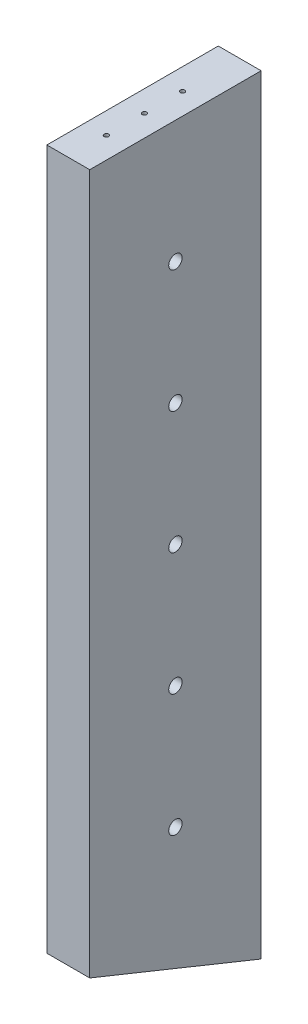
ISO-10303-21;
HEADER;
FILE_DESCRIPTION(('STEP AP214'),'2;1');
FILE_NAME('part.step','',(''),(''),'','','');
FILE_SCHEMA(('AUTOMOTIVE_DESIGN { 1 0 10303 214 1 1 1 1 }'));
ENDSEC;
DATA;
#1=APPLICATION_CONTEXT('core data for automotive mechanical design processes');
#2=APPLICATION_PROTOCOL_DEFINITION('international standard','automotive_design',2000,#1);
#3=PRODUCT_CONTEXT('',#1,'mechanical');
#4=PRODUCT('Part','Part','',(#3));
#5=PRODUCT_RELATED_PRODUCT_CATEGORY('part','',(#4));
#6=PRODUCT_DEFINITION_FORMATION('','',#4);
#7=PRODUCT_DEFINITION_CONTEXT('part definition',#1,'design');
#8=PRODUCT_DEFINITION('design','',#6,#7);
#9=PRODUCT_DEFINITION_SHAPE('','',#8);
#10=(LENGTH_UNIT() NAMED_UNIT(*) SI_UNIT(.MILLI.,.METRE.));
#11=(NAMED_UNIT(*) PLANE_ANGLE_UNIT() SI_UNIT($,.RADIAN.));
#12=(NAMED_UNIT(*) SI_UNIT($,.STERADIAN.) SOLID_ANGLE_UNIT());
#13=UNCERTAINTY_MEASURE_WITH_UNIT(LENGTH_MEASURE(1.E-05),#10,'distance_accuracy_value','');
#14=(GEOMETRIC_REPRESENTATION_CONTEXT(3) GLOBAL_UNCERTAINTY_ASSIGNED_CONTEXT((#13)) GLOBAL_UNIT_ASSIGNED_CONTEXT((#10,
#11,#12)) REPRESENTATION_CONTEXT('',''));
#15=CARTESIAN_POINT('',(0.,0.,0.));
#16=DIRECTION('',(0.,0.,1.));
#17=DIRECTION('',(1.,0.,0.));
#18=AXIS2_PLACEMENT_3D('',#15,#16,#17);
#19=CARTESIAN_POINT('',(475.477307398307,6641.74188680895,76.2));
#20=DIRECTION('',(1.,0.,0.));
#21=DIRECTION('',(0.,0.,-1.));
#22=AXIS2_PLACEMENT_3D('',#19,#20,#21);
#23=PLANE('',#22);
#24=CARTESIAN_POINT('',(475.477307398307,6929.29753945549,38.1));
#25=DIRECTION('',(-1.,0.,0.));
#26=DIRECTION('',(0.,0.,1.));
#27=AXIS2_PLACEMENT_3D('',#24,#25,#26);
#28=CIRCLE('',#27,2.9766259999997);
#29=CARTESIAN_POINT('',(475.477307398307,6929.29753945549,41.0766259999997));
#30=VERTEX_POINT('',#29);
#31=EDGE_CURVE('E469',#30,#30,#28,.T.);
#32=ORIENTED_EDGE('',*,*,#31,.F.);
#33=EDGE_LOOP('',(#32));
#34=FACE_BOUND('',#33,.T.);
#35=CARTESIAN_POINT('',(475.477307398307,6711.56773671735,38.1));
#36=DIRECTION('',(-1.,0.,0.));
#37=DIRECTION('',(0.,0.,1.));
#38=AXIS2_PLACEMENT_3D('',#35,#36,#37);
#39=CIRCLE('',#38,2.9766259999997);
#40=CARTESIAN_POINT('',(475.477307398307,6711.56773671735,41.0766259999997));
#41=VERTEX_POINT('',#40);
#42=EDGE_CURVE('E491',#41,#41,#39,.T.);
#43=ORIENTED_EDGE('',*,*,#42,.F.);
#44=EDGE_LOOP('',(#43));
#45=FACE_BOUND('',#44,.T.);
#46=DIRECTION('',(0.,-1.,0.));
#47=VECTOR('',#46,1.);
#48=CARTESIAN_POINT('',(475.477307398307,6641.74188680895,0.));
#49=LINE('',#48,#47);
#50=CARTESIAN_POINT('',(475.477307398307,6983.72999014002,0.));
#51=VERTEX_POINT('',#50);
#52=CARTESIAN_POINT('',(475.477307398307,6641.74188680895,0.));
#53=VERTEX_POINT('',#52);
#54=EDGE_CURVE('E84',#51,#53,#49,.T.);
#55=ORIENTED_EDGE('',*,*,#54,.T.);
#56=DIRECTION('',(0.,-0.374606593824928,-0.927183854401534));
#57=VECTOR('',#56,1.);
#58=CARTESIAN_POINT('',(475.477307398307,6641.74188680895,0.));
#59=LINE('',#58,#57);
#60=CARTESIAN_POINT('',(475.477307398307,6672.52868525669,76.2));
#61=VERTEX_POINT('',#60);
#62=EDGE_CURVE('E69',#61,#53,#59,.T.);
#63=ORIENTED_EDGE('',*,*,#62,.F.);
#64=DIRECTION('',(0.,-1.,0.));
#65=VECTOR('',#64,1.);
#66=CARTESIAN_POINT('',(475.477307398307,6641.74188680895,76.2));
#67=LINE('',#66,#65);
#68=CARTESIAN_POINT('',(475.477307398307,6983.72999014002,76.2));
#69=VERTEX_POINT('',#68);
#70=EDGE_CURVE('E96',#69,#61,#67,.T.);
#71=ORIENTED_EDGE('',*,*,#70,.F.);
#72=DIRECTION('',(0.,0.,-1.));
#73=VECTOR('',#72,1.);
#74=CARTESIAN_POINT('',(475.477307398307,6983.72999014002,76.2));
#75=LINE('',#74,#73);
#76=EDGE_CURVE('E42',#69,#51,#75,.T.);
#77=ORIENTED_EDGE('',*,*,#76,.T.);
#78=EDGE_LOOP('',(#55,#63,#71,#77));
#79=FACE_BOUND('',#78,.T.);
#80=CARTESIAN_POINT('',(475.477307398307,6766.00018740189,38.1));
#81=DIRECTION('',(-1.,0.,0.));
#82=DIRECTION('',(0.,0.,1.));
#83=AXIS2_PLACEMENT_3D('',#80,#81,#82);
#84=CIRCLE('',#83,2.9766259999997);
#85=CARTESIAN_POINT('',(475.477307398307,6766.00018740189,41.0766259999997));
#86=VERTEX_POINT('',#85);
#87=EDGE_CURVE('E485',#86,#86,#84,.T.);
#88=ORIENTED_EDGE('',*,*,#87,.F.);
#89=EDGE_LOOP('',(#88));
#90=FACE_BOUND('',#89,.T.);
#91=CARTESIAN_POINT('',(475.477307398307,6820.43263808642,38.1));
#92=DIRECTION('',(-1.,0.,0.));
#93=DIRECTION('',(0.,0.,1.));
#94=AXIS2_PLACEMENT_3D('',#91,#92,#93);
#95=CIRCLE('',#94,2.9766259999997);
#96=CARTESIAN_POINT('',(475.477307398307,6820.43263808642,41.0766259999997));
#97=VERTEX_POINT('',#96);
#98=EDGE_CURVE('E479',#97,#97,#95,.T.);
#99=ORIENTED_EDGE('',*,*,#98,.F.);
#100=EDGE_LOOP('',(#99));
#101=FACE_BOUND('',#100,.T.);
#102=CARTESIAN_POINT('',(475.477307398307,6874.86508877095,38.1));
#103=DIRECTION('',(-1.,0.,0.));
#104=DIRECTION('',(0.,0.,1.));
#105=AXIS2_PLACEMENT_3D('',#102,#103,#104);
#106=CIRCLE('',#105,2.9766259999997);
#107=CARTESIAN_POINT('',(475.477307398307,6874.86508877095,41.0766259999997));
#108=VERTEX_POINT('',#107);
#109=EDGE_CURVE('E471',#108,#108,#106,.T.);
#110=ORIENTED_EDGE('',*,*,#109,.F.);
#111=EDGE_LOOP('',(#110));
#112=FACE_BOUND('',#111,.T.);
#113=ADVANCED_FACE('F32',(#34,#45,#79,#90,#101,#112),#23,.F.);
#114=CARTESIAN_POINT('',(494.527307398307,6641.74188680895,76.2));
#115=DIRECTION('',(-1.,0.,0.));
#116=DIRECTION('',(0.,0.,1.));
#117=AXIS2_PLACEMENT_3D('',#114,#115,#116);
#118=PLANE('',#117);
#119=CARTESIAN_POINT('',(494.527307398307,6929.29753945549,38.1));
#120=DIRECTION('',(-1.,0.,0.));
#121=DIRECTION('',(0.,0.,1.));
#122=AXIS2_PLACEMENT_3D('',#119,#120,#121);
#123=CIRCLE('',#122,2.9766259999997);
#124=CARTESIAN_POINT('',(494.527307398307,6929.29753945549,41.0766259999997));
#125=VERTEX_POINT('',#124);
#126=EDGE_CURVE('E467',#125,#125,#123,.T.);
#127=ORIENTED_EDGE('',*,*,#126,.T.);
#128=EDGE_LOOP('',(#127));
#129=FACE_BOUND('',#128,.T.);
#130=CARTESIAN_POINT('',(494.527307398307,6874.86508877095,38.1));
#131=DIRECTION('',(-1.,0.,0.));
#132=DIRECTION('',(0.,0.,1.));
#133=AXIS2_PLACEMENT_3D('',#130,#131,#132);
#134=CIRCLE('',#133,2.9766259999997);
#135=CARTESIAN_POINT('',(494.527307398307,6874.86508877095,41.0766259999997));
#136=VERTEX_POINT('',#135);
#137=EDGE_CURVE('E476',#136,#136,#134,.T.);
#138=ORIENTED_EDGE('',*,*,#137,.T.);
#139=EDGE_LOOP('',(#138));
#140=FACE_BOUND('',#139,.T.);
#141=CARTESIAN_POINT('',(494.527307398307,6820.43263808642,38.1));
#142=DIRECTION('',(-1.,0.,0.));
#143=DIRECTION('',(0.,0.,1.));
#144=AXIS2_PLACEMENT_3D('',#141,#142,#143);
#145=CIRCLE('',#144,2.9766259999997);
#146=CARTESIAN_POINT('',(494.527307398307,6820.43263808642,41.0766259999997));
#147=VERTEX_POINT('',#146);
#148=EDGE_CURVE('E482',#147,#147,#145,.T.);
#149=ORIENTED_EDGE('',*,*,#148,.T.);
#150=EDGE_LOOP('',(#149));
#151=FACE_BOUND('',#150,.T.);
#152=CARTESIAN_POINT('',(494.527307398307,6766.00018740189,38.1));
#153=DIRECTION('',(-1.,0.,0.));
#154=DIRECTION('',(0.,0.,1.));
#155=AXIS2_PLACEMENT_3D('',#152,#153,#154);
#156=CIRCLE('',#155,2.9766259999997);
#157=CARTESIAN_POINT('',(494.527307398307,6766.00018740189,41.0766259999997));
#158=VERTEX_POINT('',#157);
#159=EDGE_CURVE('E488',#158,#158,#156,.T.);
#160=ORIENTED_EDGE('',*,*,#159,.T.);
#161=EDGE_LOOP('',(#160));
#162=FACE_BOUND('',#161,.T.);
#163=CARTESIAN_POINT('',(494.527307398307,6711.56773671735,38.1));
#164=DIRECTION('',(-1.,0.,0.));
#165=DIRECTION('',(0.,0.,1.));
#166=AXIS2_PLACEMENT_3D('',#163,#164,#165);
#167=CIRCLE('',#166,2.9766259999997);
#168=CARTESIAN_POINT('',(494.527307398307,6711.56773671735,41.0766259999997));
#169=VERTEX_POINT('',#168);
#170=EDGE_CURVE('E174',#169,#169,#167,.T.);
#171=ORIENTED_EDGE('',*,*,#170,.T.);
#172=EDGE_LOOP('',(#171));
#173=FACE_BOUND('',#172,.T.);
#174=DIRECTION('',(0.,1.,0.));
#175=VECTOR('',#174,1.);
#176=CARTESIAN_POINT('',(494.527307398307,6641.74188680895,76.2));
#177=LINE('',#176,#175);
#178=CARTESIAN_POINT('',(494.527307398307,6672.52868525669,76.2));
#179=VERTEX_POINT('',#178);
#180=CARTESIAN_POINT('',(494.527307398307,6983.72999014003,76.2));
#181=VERTEX_POINT('',#180);
#182=EDGE_CURVE('E91',#179,#181,#177,.T.);
#183=ORIENTED_EDGE('',*,*,#182,.F.);
#184=DIRECTION('',(0.,0.374606593824928,0.927183854401534));
#185=VECTOR('',#184,1.);
#186=CARTESIAN_POINT('',(494.527307398307,6641.74188680895,0.));
#187=LINE('',#186,#185);
#188=CARTESIAN_POINT('',(494.527307398307,6641.74188680895,0.));
#189=VERTEX_POINT('',#188);
#190=EDGE_CURVE('E100',#189,#179,#187,.T.);
#191=ORIENTED_EDGE('',*,*,#190,.F.);
#192=DIRECTION('',(0.,1.,0.));
#193=VECTOR('',#192,1.);
#194=CARTESIAN_POINT('',(494.527307398307,6641.74188680895,0.));
#195=LINE('',#194,#193);
#196=CARTESIAN_POINT('',(494.527307398307,6983.72999014003,0.));
#197=VERTEX_POINT('',#196);
#198=EDGE_CURVE('E81',#189,#197,#195,.T.);
#199=ORIENTED_EDGE('',*,*,#198,.T.);
#200=DIRECTION('',(0.,0.,-1.));
#201=VECTOR('',#200,1.);
#202=CARTESIAN_POINT('',(494.527307398307,6983.72999014003,76.2));
#203=LINE('',#202,#201);
#204=EDGE_CURVE('E11',#181,#197,#203,.T.);
#205=ORIENTED_EDGE('',*,*,#204,.F.);
#206=EDGE_LOOP('',(#183,#191,#199,#205));
#207=FACE_BOUND('',#206,.T.);
#208=ADVANCED_FACE('F34',(#129,#140,#151,#162,#173,#207),#118,.F.);
#209=CARTESIAN_POINT('',(494.527307398307,6983.72999014003,76.2));
#210=DIRECTION('',(5.59482469102441E-13,-1.,0.));
#211=DIRECTION('',(1.,5.59482469102441E-13,0.));
#212=AXIS2_PLACEMENT_3D('',#209,#210,#211);
#213=PLANE('',#212);
#214=CARTESIAN_POINT('',(485.002307398307,6983.72999014003,25.4));
#215=DIRECTION('',(0.,1.,0.));
#216=DIRECTION('',(0.,0.,1.));
#217=AXIS2_PLACEMENT_3D('',#214,#215,#216);
#218=CIRCLE('',#217,0.992251);
#219=CARTESIAN_POINT('',(485.002307398307,6983.72999014003,26.392251));
#220=VERTEX_POINT('',#219);
#221=EDGE_CURVE('E186',#220,#220,#218,.T.);
#222=ORIENTED_EDGE('',*,*,#221,.F.);
#223=EDGE_LOOP('',(#222));
#224=FACE_BOUND('',#223,.T.);
#225=CARTESIAN_POINT('',(485.002307398307,6983.72999014003,42.3333333333333));
#226=DIRECTION('',(0.,1.,0.));
#227=DIRECTION('',(0.,0.,1.));
#228=AXIS2_PLACEMENT_3D('',#225,#226,#227);
#229=CIRCLE('',#228,0.992251);
#230=CARTESIAN_POINT('',(485.002307398307,6983.72999014003,43.3255843333333));
#231=VERTEX_POINT('',#230);
#232=EDGE_CURVE('E192',#231,#231,#229,.T.);
#233=ORIENTED_EDGE('',*,*,#232,.F.);
#234=EDGE_LOOP('',(#233));
#235=FACE_BOUND('',#234,.T.);
#236=CARTESIAN_POINT('',(485.002307398307,6983.72999014003,59.2666666666667));
#237=DIRECTION('',(0.,1.,0.));
#238=DIRECTION('',(0.,0.,1.));
#239=AXIS2_PLACEMENT_3D('',#236,#237,#238);
#240=CIRCLE('',#239,0.992251);
#241=CARTESIAN_POINT('',(485.002307398307,6983.72999014003,60.2589176666667));
#242=VERTEX_POINT('',#241);
#243=EDGE_CURVE('E198',#242,#242,#240,.T.);
#244=ORIENTED_EDGE('',*,*,#243,.F.);
#245=EDGE_LOOP('',(#244));
#246=FACE_BOUND('',#245,.T.);
#247=DIRECTION('',(-1.,-5.59482469102441E-13,0.));
#248=VECTOR('',#247,1.);
#249=CARTESIAN_POINT('',(494.527307398307,6983.72999014003,0.));
#250=LINE('',#249,#248);
#251=EDGE_CURVE('E62',#197,#51,#250,.T.);
#252=ORIENTED_EDGE('',*,*,#251,.T.);
#253=ORIENTED_EDGE('',*,*,#76,.F.);
#254=DIRECTION('',(-1.,-5.59482469102441E-13,0.));
#255=VECTOR('',#254,1.);
#256=CARTESIAN_POINT('',(494.527307398307,6983.72999014003,76.2));
#257=LINE('',#256,#255);
#258=EDGE_CURVE('E51',#181,#69,#257,.T.);
#259=ORIENTED_EDGE('',*,*,#258,.F.);
#260=ORIENTED_EDGE('',*,*,#204,.T.);
#261=EDGE_LOOP('',(#252,#253,#259,#260));
#262=FACE_BOUND('',#261,.T.);
#263=ADVANCED_FACE('F243',(#224,#235,#246,#262),#213,.F.);
#264=CARTESIAN_POINT('',(0.,0.,76.2));
#265=DIRECTION('',(0.,0.,1.));
#266=DIRECTION('',(1.,0.,0.));
#267=AXIS2_PLACEMENT_3D('',#264,#265,#266);
#268=PLANE('',#267);
#269=DIRECTION('',(1.,0.,0.));
#270=VECTOR('',#269,1.);
#271=CARTESIAN_POINT('',(475.476307398307,6672.52868525669,76.2));
#272=LINE('',#271,#270);
#273=EDGE_CURVE('E78',#61,#179,#272,.T.);
#274=ORIENTED_EDGE('',*,*,#273,.T.);
#275=ORIENTED_EDGE('',*,*,#182,.T.);
#276=ORIENTED_EDGE('',*,*,#258,.T.);
#277=ORIENTED_EDGE('',*,*,#70,.T.);
#278=EDGE_LOOP('',(#274,#275,#276,#277));
#279=FACE_BOUND('',#278,.T.);
#280=ADVANCED_FACE('F129',(#279),#268,.T.);
#281=CARTESIAN_POINT('',(0.,0.,0.));
#282=DIRECTION('',(0.,0.,1.));
#283=DIRECTION('',(1.,0.,0.));
#284=AXIS2_PLACEMENT_3D('',#281,#282,#283);
#285=PLANE('',#284);
#286=CARTESIAN_POINT('',(485.002307398328,6660.33593847449,0.));
#287=DIRECTION('',(0.,0.,1.));
#288=DIRECTION('',(1.,0.,0.));
#289=AXIS2_PLACEMENT_3D('',#286,#287,#288);
#290=CIRCLE('',#289,0.992251);
#291=CARTESIAN_POINT('',(485.994558398328,6660.33593847449,0.));
#292=VERTEX_POINT('',#291);
#293=EDGE_CURVE('E36',#292,#292,#290,.T.);
#294=ORIENTED_EDGE('',*,*,#293,.T.);
#295=EDGE_LOOP('',(#294));
#296=FACE_BOUND('',#295,.T.);
#297=CARTESIAN_POINT('',(485.002307398328,6812.73593847449,0.));
#298=DIRECTION('',(0.,0.,1.));
#299=DIRECTION('',(1.,0.,0.));
#300=AXIS2_PLACEMENT_3D('',#297,#298,#299);
#301=CIRCLE('',#300,0.992251);
#302=CARTESIAN_POINT('',(485.994558398328,6812.73593847449,0.));
#303=VERTEX_POINT('',#302);
#304=EDGE_CURVE('E102',#303,#303,#301,.T.);
#305=ORIENTED_EDGE('',*,*,#304,.T.);
#306=EDGE_LOOP('',(#305));
#307=FACE_BOUND('',#306,.T.);
#308=CARTESIAN_POINT('',(485.002307398328,6965.13593847449,0.));
#309=DIRECTION('',(0.,0.,1.));
#310=DIRECTION('',(1.,0.,0.));
#311=AXIS2_PLACEMENT_3D('',#308,#309,#310);
#312=CIRCLE('',#311,0.992251);
#313=CARTESIAN_POINT('',(485.994558398328,6965.13593847449,0.));
#314=VERTEX_POINT('',#313);
#315=EDGE_CURVE('E98',#314,#314,#312,.T.);
#316=ORIENTED_EDGE('',*,*,#315,.T.);
#317=EDGE_LOOP('',(#316));
#318=FACE_BOUND('',#317,.T.);
#319=ORIENTED_EDGE('',*,*,#198,.F.);
#320=DIRECTION('',(1.,0.,0.));
#321=VECTOR('',#320,1.);
#322=CARTESIAN_POINT('',(494.527307398307,6641.74188680895,0.));
#323=LINE('',#322,#321);
#324=EDGE_CURVE('E75',#53,#189,#323,.T.);
#325=ORIENTED_EDGE('',*,*,#324,.F.);
#326=ORIENTED_EDGE('',*,*,#54,.F.);
#327=ORIENTED_EDGE('',*,*,#251,.F.);
#328=EDGE_LOOP('',(#319,#325,#326,#327));
#329=FACE_BOUND('',#328,.T.);
#330=ADVANCED_FACE('F89',(#296,#307,#318,#329),#285,.F.);
#331=CARTESIAN_POINT('',(475.476307398307,6641.74188680895,0.));
#332=DIRECTION('',(0.,0.927183854401535,-0.374606593824928));
#333=DIRECTION('',(0.,0.374606593824928,0.927183854401535));
#334=AXIS2_PLACEMENT_3D('',#331,#332,#333);
#335=PLANE('',#334);
#336=CARTESIAN_POINT('',(485.002307398307,6666.23100555876,60.6126957924156));
#337=DIRECTION('',(0.,-0.927183854401535,0.374606593824928));
#338=DIRECTION('',(0.,-0.374606593824928,-0.927183854401535));
#339=AXIS2_PLACEMENT_3D('',#336,#337,#338);
#340=CIRCLE('',#339,0.992251);
#341=CARTESIAN_POINT('',(485.002307398307,6665.85930179143,59.6926966857018));
#342=VERTEX_POINT('',#341);
#343=EDGE_CURVE('E168',#342,#342,#340,.T.);
#344=ORIENTED_EDGE('',*,*,#343,.F.);
#345=EDGE_LOOP('',(#344));
#346=FACE_BOUND('',#345,.T.);
#347=CARTESIAN_POINT('',(485.002307398307,6659.93332586082,45.025391584832));
#348=DIRECTION('',(0.,-0.927183854401535,0.374606593824928));
#349=DIRECTION('',(0.,-0.374606593824928,-0.927183854401535));
#350=AXIS2_PLACEMENT_3D('',#347,#348,#349);
#351=CIRCLE('',#350,0.992251);
#352=CARTESIAN_POINT('',(485.002307398307,6659.56162209349,44.1053924781182));
#353=VERTEX_POINT('',#352);
#354=EDGE_CURVE('E167',#353,#353,#351,.T.);
#355=ORIENTED_EDGE('',*,*,#354,.F.);
#356=EDGE_LOOP('',(#355));
#357=FACE_BOUND('',#356,.T.);
#358=CARTESIAN_POINT('',(485.002307398307,6653.63564616289,29.4380873772484));
#359=DIRECTION('',(0.,-0.927183854401535,0.374606593824928));
#360=DIRECTION('',(0.,-0.374606593824928,-0.927183854401535));
#361=AXIS2_PLACEMENT_3D('',#358,#359,#360);
#362=CIRCLE('',#361,0.992251);
#363=CARTESIAN_POINT('',(485.002307398307,6653.26394239556,28.5180882705346));
#364=VERTEX_POINT('',#363);
#365=EDGE_CURVE('E180',#364,#364,#362,.T.);
#366=ORIENTED_EDGE('',*,*,#365,.F.);
#367=EDGE_LOOP('',(#366));
#368=FACE_BOUND('',#367,.T.);
#369=ORIENTED_EDGE('',*,*,#62,.T.);
#370=ORIENTED_EDGE('',*,*,#324,.T.);
#371=ORIENTED_EDGE('',*,*,#190,.T.);
#372=ORIENTED_EDGE('',*,*,#273,.F.);
#373=EDGE_LOOP('',(#369,#370,#371,#372));
#374=FACE_BOUND('',#373,.T.);
#375=ADVANCED_FACE('F71',(#346,#357,#368,#374),#335,.F.);
#376=CARTESIAN_POINT('',(485.002307398328,6965.13593846609,-19.050000046008));
#377=DIRECTION('',(0.,-4.41081850666353E-10,-1.));
#378=DIRECTION('',(0.,1.,-4.41081850666353E-10));
#379=AXIS2_PLACEMENT_3D('',#376,#377,#378);
#380=CYLINDRICAL_SURFACE('',#379,0.992251);
#381=CARTESIAN_POINT('',(485.002307398328,6965.13593848289,19.049999953992));
#382=DIRECTION('',(0.,-4.41081850666353E-10,-1.));
#383=DIRECTION('',(0.,1.,-4.41081850666353E-10));
#384=AXIS2_PLACEMENT_3D('',#381,#382,#383);
#385=CIRCLE('',#384,0.992251);
#386=CARTESIAN_POINT('',(485.002307398328,6966.12818948289,19.0499999535544));
#387=VERTEX_POINT('',#386);
#388=EDGE_CURVE('E101',#387,#387,#385,.T.);
#389=ORIENTED_EDGE('',*,*,#388,.F.);
#390=EDGE_LOOP('',(#389));
#391=FACE_BOUND('',#390,.T.);
#392=ORIENTED_EDGE('',*,*,#315,.F.);
#393=EDGE_LOOP('',(#392));
#394=FACE_BOUND('',#393,.T.);
#395=ADVANCED_FACE('F221',(#391,#394),#380,.F.);
#396=CARTESIAN_POINT('',(485.002307398328,6965.13593848289,19.049999953992));
#397=DIRECTION('',(0.,-4.41081850666353E-10,-1.));
#398=DIRECTION('',(0.,1.,-4.41081850666353E-10));
#399=AXIS2_PLACEMENT_3D('',#396,#397,#398);
#400=CONICAL_SURFACE('',#399,0.992251,1.02974425867666);
#401=CARTESIAN_POINT('',(485.002307398328,6965.13593848315,19.6462045040827));
#402=VERTEX_POINT('',#401);
#403=VERTEX_LOOP('',#402);
#404=FACE_BOUND('',#403,.T.);
#405=ORIENTED_EDGE('',*,*,#388,.T.);
#406=EDGE_LOOP('',(#405));
#407=FACE_BOUND('',#406,.T.);
#408=ADVANCED_FACE('F223',(#404,#407),#400,.F.);
#409=CARTESIAN_POINT('',(485.002307398328,6812.73593846609,-19.0499999787871));
#410=DIRECTION('',(0.,-4.41081850666353E-10,-1.));
#411=DIRECTION('',(0.,1.,-4.41081850666353E-10));
#412=AXIS2_PLACEMENT_3D('',#409,#410,#411);
#413=CYLINDRICAL_SURFACE('',#412,0.992251);
#414=CARTESIAN_POINT('',(485.002307398328,6812.73593848289,19.0500000212129));
#415=DIRECTION('',(0.,-4.41081850666353E-10,-1.));
#416=DIRECTION('',(0.,1.,-4.41081850666353E-10));
#417=AXIS2_PLACEMENT_3D('',#414,#415,#416);
#418=CIRCLE('',#417,0.992251);
#419=CARTESIAN_POINT('',(485.002307398328,6813.72818948289,19.0500000207752));
#420=VERTEX_POINT('',#419);
#421=EDGE_CURVE('E104',#420,#420,#418,.T.);
#422=ORIENTED_EDGE('',*,*,#421,.F.);
#423=EDGE_LOOP('',(#422));
#424=FACE_BOUND('',#423,.T.);
#425=ORIENTED_EDGE('',*,*,#304,.F.);
#426=EDGE_LOOP('',(#425));
#427=FACE_BOUND('',#426,.T.);
#428=ADVANCED_FACE('F230',(#424,#427),#413,.F.);
#429=CARTESIAN_POINT('',(485.002307398328,6812.73593848289,19.0500000212129));
#430=DIRECTION('',(0.,-4.41081850666353E-10,-1.));
#431=DIRECTION('',(0.,1.,-4.41081850666353E-10));
#432=AXIS2_PLACEMENT_3D('',#429,#430,#431);
#433=CONICAL_SURFACE('',#432,0.992251,1.02974425867666);
#434=CARTESIAN_POINT('',(485.002307398328,6812.73593848315,19.6462045713036));
#435=VERTEX_POINT('',#434);
#436=VERTEX_LOOP('',#435);
#437=FACE_BOUND('',#436,.T.);
#438=ORIENTED_EDGE('',*,*,#421,.T.);
#439=EDGE_LOOP('',(#438));
#440=FACE_BOUND('',#439,.T.);
#441=ADVANCED_FACE('F212',(#437,#440),#433,.F.);
#442=CARTESIAN_POINT('',(485.002307398328,6660.33593846608,-19.0499999115662));
#443=DIRECTION('',(0.,-4.41081850666353E-10,-1.));
#444=DIRECTION('',(0.,1.,-4.41081850666353E-10));
#445=AXIS2_PLACEMENT_3D('',#442,#443,#444);
#446=CYLINDRICAL_SURFACE('',#445,0.992251);
#447=CARTESIAN_POINT('',(485.002307398328,6660.33593848289,19.0500000884338));
#448=DIRECTION('',(0.,-4.41081850666353E-10,-1.));
#449=DIRECTION('',(0.,1.,-4.41081850666353E-10));
#450=AXIS2_PLACEMENT_3D('',#447,#448,#449);
#451=CIRCLE('',#450,0.992251);
#452=CARTESIAN_POINT('',(485.002307398328,6661.32818948289,19.0500000879961));
#453=VERTEX_POINT('',#452);
#454=EDGE_CURVE('E114',#453,#453,#451,.T.);
#455=ORIENTED_EDGE('',*,*,#454,.F.);
#456=EDGE_LOOP('',(#455));
#457=FACE_BOUND('',#456,.T.);
#458=ORIENTED_EDGE('',*,*,#293,.F.);
#459=EDGE_LOOP('',(#458));
#460=FACE_BOUND('',#459,.T.);
#461=ADVANCED_FACE('F209',(#457,#460),#446,.F.);
#462=CARTESIAN_POINT('',(485.002307398328,6660.33593848289,19.0500000884338));
#463=DIRECTION('',(0.,-4.41081850666353E-10,-1.));
#464=DIRECTION('',(0.,1.,-4.41081850666353E-10));
#465=AXIS2_PLACEMENT_3D('',#462,#463,#464);
#466=CONICAL_SURFACE('',#465,0.992251,1.02974425867666);
#467=CARTESIAN_POINT('',(485.002307398328,6660.33593848315,19.6462046385245));
#468=VERTEX_POINT('',#467);
#469=VERTEX_LOOP('',#468);
#470=FACE_BOUND('',#469,.T.);
#471=ORIENTED_EDGE('',*,*,#454,.T.);
#472=EDGE_LOOP('',(#471));
#473=FACE_BOUND('',#472,.T.);
#474=ADVANCED_FACE('F207',(#470,#473),#466,.F.);
#475=CARTESIAN_POINT('',(485.002307398307,6964.67999014003,59.2666666666667));
#476=DIRECTION('',(0.,1.,0.));
#477=DIRECTION('',(0.,0.,1.));
#478=AXIS2_PLACEMENT_3D('',#475,#476,#477);
#479=CONICAL_SURFACE('',#478,0.992251,1.02974425867684);
#480=CARTESIAN_POINT('',(485.002307398307,6964.08378558994,59.2666666666667));
#481=VERTEX_POINT('',#480);
#482=VERTEX_LOOP('',#481);
#483=FACE_BOUND('',#482,.T.);
#484=CARTESIAN_POINT('',(485.002307398307,6964.67999014003,59.2666666666667));
#485=DIRECTION('',(0.,1.,0.));
#486=DIRECTION('',(0.,0.,1.));
#487=AXIS2_PLACEMENT_3D('',#484,#485,#486);
#488=CIRCLE('',#487,0.992251);
#489=CARTESIAN_POINT('',(485.002307398307,6964.67999014003,60.2589176666667));
#490=VERTEX_POINT('',#489);
#491=EDGE_CURVE('E200',#490,#490,#488,.T.);
#492=ORIENTED_EDGE('',*,*,#491,.T.);
#493=EDGE_LOOP('',(#492));
#494=FACE_BOUND('',#493,.T.);
#495=ADVANCED_FACE('F262',(#483,#494),#479,.F.);
#496=CARTESIAN_POINT('',(485.002307398307,6983.72999014003,59.2666666666667));
#497=DIRECTION('',(0.,1.,0.));
#498=DIRECTION('',(0.,0.,1.));
#499=AXIS2_PLACEMENT_3D('',#496,#497,#498);
#500=CYLINDRICAL_SURFACE('',#499,0.992251);
#501=ORIENTED_EDGE('',*,*,#491,.F.);
#502=EDGE_LOOP('',(#501));
#503=FACE_BOUND('',#502,.T.);
#504=ORIENTED_EDGE('',*,*,#243,.T.);
#505=EDGE_LOOP('',(#504));
#506=FACE_BOUND('',#505,.T.);
#507=ADVANCED_FACE('F259',(#503,#506),#500,.F.);
#508=CARTESIAN_POINT('',(485.002307398307,6964.67999014003,42.3333333333333));
#509=DIRECTION('',(0.,1.,0.));
#510=DIRECTION('',(0.,0.,1.));
#511=AXIS2_PLACEMENT_3D('',#508,#509,#510);
#512=CONICAL_SURFACE('',#511,0.992251,1.02974425867684);
#513=CARTESIAN_POINT('',(485.002307398307,6964.08378558994,42.3333333333333));
#514=VERTEX_POINT('',#513);
#515=VERTEX_LOOP('',#514);
#516=FACE_BOUND('',#515,.T.);
#517=CARTESIAN_POINT('',(485.002307398307,6964.67999014003,42.3333333333333));
#518=DIRECTION('',(0.,1.,0.));
#519=DIRECTION('',(0.,0.,1.));
#520=AXIS2_PLACEMENT_3D('',#517,#518,#519);
#521=CIRCLE('',#520,0.992251);
#522=CARTESIAN_POINT('',(485.002307398307,6964.67999014003,43.3255843333333));
#523=VERTEX_POINT('',#522);
#524=EDGE_CURVE('E195',#523,#523,#521,.T.);
#525=ORIENTED_EDGE('',*,*,#524,.T.);
#526=EDGE_LOOP('',(#525));
#527=FACE_BOUND('',#526,.T.);
#528=ADVANCED_FACE('F261',(#516,#527),#512,.F.);
#529=CARTESIAN_POINT('',(485.002307398307,6983.72999014003,42.3333333333333));
#530=DIRECTION('',(0.,1.,0.));
#531=DIRECTION('',(0.,0.,1.));
#532=AXIS2_PLACEMENT_3D('',#529,#530,#531);
#533=CYLINDRICAL_SURFACE('',#532,0.992251);
#534=ORIENTED_EDGE('',*,*,#524,.F.);
#535=EDGE_LOOP('',(#534));
#536=FACE_BOUND('',#535,.T.);
#537=ORIENTED_EDGE('',*,*,#232,.T.);
#538=EDGE_LOOP('',(#537));
#539=FACE_BOUND('',#538,.T.);
#540=ADVANCED_FACE('F269',(#536,#539),#533,.F.);
#541=CARTESIAN_POINT('',(485.002307398307,6964.67999014003,25.4));
#542=DIRECTION('',(0.,1.,0.));
#543=DIRECTION('',(0.,0.,1.));
#544=AXIS2_PLACEMENT_3D('',#541,#542,#543);
#545=CONICAL_SURFACE('',#544,0.992251,1.02974425867684);
#546=CARTESIAN_POINT('',(485.002307398307,6964.08378558994,25.4));
#547=VERTEX_POINT('',#546);
#548=VERTEX_LOOP('',#547);
#549=FACE_BOUND('',#548,.T.);
#550=CARTESIAN_POINT('',(485.002307398307,6964.67999014003,25.4));
#551=DIRECTION('',(0.,1.,0.));
#552=DIRECTION('',(0.,0.,1.));
#553=AXIS2_PLACEMENT_3D('',#550,#551,#552);
#554=CIRCLE('',#553,0.992251);
#555=CARTESIAN_POINT('',(485.002307398307,6964.67999014003,26.392251));
#556=VERTEX_POINT('',#555);
#557=EDGE_CURVE('E189',#556,#556,#554,.T.);
#558=ORIENTED_EDGE('',*,*,#557,.T.);
#559=EDGE_LOOP('',(#558));
#560=FACE_BOUND('',#559,.T.);
#561=ADVANCED_FACE('F320',(#549,#560),#545,.F.);
#562=CARTESIAN_POINT('',(485.002307398307,6983.72999014003,25.4));
#563=DIRECTION('',(0.,1.,0.));
#564=DIRECTION('',(0.,0.,1.));
#565=AXIS2_PLACEMENT_3D('',#562,#563,#564);
#566=CYLINDRICAL_SURFACE('',#565,0.992251);
#567=ORIENTED_EDGE('',*,*,#557,.F.);
#568=EDGE_LOOP('',(#567));
#569=FACE_BOUND('',#568,.T.);
#570=ORIENTED_EDGE('',*,*,#221,.T.);
#571=EDGE_LOOP('',(#570));
#572=FACE_BOUND('',#571,.T.);
#573=ADVANCED_FACE('F329',(#569,#572),#566,.F.);
#574=CARTESIAN_POINT('',(485.002307398307,6671.29849858924,22.3018317648834));
#575=DIRECTION('',(0.,-0.927183854401535,0.374606593824928));
#576=DIRECTION('',(0.,-0.374606593824928,-0.927183854401535));
#577=AXIS2_PLACEMENT_3D('',#574,#575,#576);
#578=CONICAL_SURFACE('',#577,0.992251,1.0297442586769);
#579=CARTESIAN_POINT('',(485.002307398307,6671.851289822,22.0784896091511));
#580=VERTEX_POINT('',#579);
#581=VERTEX_LOOP('',#580);
#582=FACE_BOUND('',#581,.T.);
#583=CARTESIAN_POINT('',(485.002307398307,6671.29849858924,22.3018317648834));
#584=DIRECTION('',(0.,-0.927183854401535,0.374606593824928));
#585=DIRECTION('',(0.,-0.374606593824928,-0.927183854401535));
#586=AXIS2_PLACEMENT_3D('',#583,#584,#585);
#587=CIRCLE('',#586,0.992251);
#588=CARTESIAN_POINT('',(485.002307398307,6670.92679482191,21.3818326581696));
#589=VERTEX_POINT('',#588);
#590=EDGE_CURVE('E183',#589,#589,#587,.T.);
#591=ORIENTED_EDGE('',*,*,#590,.T.);
#592=EDGE_LOOP('',(#591));
#593=FACE_BOUND('',#592,.T.);
#594=ADVANCED_FACE('F339',(#582,#593),#578,.F.);
#595=CARTESIAN_POINT('',(485.002307398307,6653.63564616289,29.4380873772484));
#596=DIRECTION('',(0.,-0.927183854401535,0.374606593824928));
#597=DIRECTION('',(0.,-0.374606593824928,-0.927183854401535));
#598=AXIS2_PLACEMENT_3D('',#595,#596,#597);
#599=CYLINDRICAL_SURFACE('',#598,0.992251);
#600=ORIENTED_EDGE('',*,*,#590,.F.);
#601=EDGE_LOOP('',(#600));
#602=FACE_BOUND('',#601,.T.);
#603=ORIENTED_EDGE('',*,*,#365,.T.);
#604=EDGE_LOOP('',(#603));
#605=FACE_BOUND('',#604,.T.);
#606=ADVANCED_FACE('F357',(#602,#605),#599,.F.);
#607=CARTESIAN_POINT('',(485.002307398307,6677.59617828717,37.889135972467));
#608=DIRECTION('',(0.,-0.927183854401535,0.374606593824928));
#609=DIRECTION('',(0.,-0.374606593824928,-0.927183854401535));
#610=AXIS2_PLACEMENT_3D('',#607,#608,#609);
#611=CONICAL_SURFACE('',#610,0.992251,1.0297442586769);
#612=CARTESIAN_POINT('',(485.002307398307,6678.14896951994,37.6657938167347));
#613=VERTEX_POINT('',#612);
#614=VERTEX_LOOP('',#613);
#615=FACE_BOUND('',#614,.T.);
#616=CARTESIAN_POINT('',(485.002307398307,6677.59617828717,37.889135972467));
#617=DIRECTION('',(0.,-0.927183854401535,0.374606593824928));
#618=DIRECTION('',(0.,-0.374606593824928,-0.927183854401535));
#619=AXIS2_PLACEMENT_3D('',#616,#617,#618);
#620=CIRCLE('',#619,0.992251);
#621=CARTESIAN_POINT('',(485.002307398307,6677.22447451984,36.9691368657532));
#622=VERTEX_POINT('',#621);
#623=EDGE_CURVE('E171',#622,#622,#620,.T.);
#624=ORIENTED_EDGE('',*,*,#623,.T.);
#625=EDGE_LOOP('',(#624));
#626=FACE_BOUND('',#625,.T.);
#627=ADVANCED_FACE('F367',(#615,#626),#611,.F.);
#628=CARTESIAN_POINT('',(485.002307398307,6659.93332586082,45.025391584832));
#629=DIRECTION('',(0.,-0.927183854401535,0.374606593824928));
#630=DIRECTION('',(0.,-0.374606593824928,-0.927183854401535));
#631=AXIS2_PLACEMENT_3D('',#628,#629,#630);
#632=CYLINDRICAL_SURFACE('',#631,0.992251);
#633=ORIENTED_EDGE('',*,*,#623,.F.);
#634=EDGE_LOOP('',(#633));
#635=FACE_BOUND('',#634,.T.);
#636=ORIENTED_EDGE('',*,*,#354,.T.);
#637=EDGE_LOOP('',(#636));
#638=FACE_BOUND('',#637,.T.);
#639=ADVANCED_FACE('F161',(#635,#638),#632,.F.);
#640=CARTESIAN_POINT('',(485.002307398307,6683.89385798511,53.4764401800506));
#641=DIRECTION('',(0.,-0.927183854401535,0.374606593824928));
#642=DIRECTION('',(0.,-0.374606593824928,-0.927183854401535));
#643=AXIS2_PLACEMENT_3D('',#640,#641,#642);
#644=CONICAL_SURFACE('',#643,0.992251,1.0297442586769);
#645=CARTESIAN_POINT('',(485.002307398307,6684.44664921787,53.2530980243183));
#646=VERTEX_POINT('',#645);
#647=VERTEX_LOOP('',#646);
#648=FACE_BOUND('',#647,.T.);
#649=CARTESIAN_POINT('',(485.002307398307,6683.89385798511,53.4764401800506));
#650=DIRECTION('',(0.,-0.927183854401535,0.374606593824928));
#651=DIRECTION('',(0.,-0.374606593824928,-0.927183854401535));
#652=AXIS2_PLACEMENT_3D('',#649,#650,#651);
#653=CIRCLE('',#652,0.992251);
#654=CARTESIAN_POINT('',(485.002307398307,6683.52215421778,52.5564410733368));
#655=VERTEX_POINT('',#654);
#656=EDGE_CURVE('E165',#655,#655,#653,.T.);
#657=ORIENTED_EDGE('',*,*,#656,.T.);
#658=EDGE_LOOP('',(#657));
#659=FACE_BOUND('',#658,.T.);
#660=ADVANCED_FACE('F157',(#648,#659),#644,.F.);
#661=CARTESIAN_POINT('',(485.002307398307,6666.23100555876,60.6126957924156));
#662=DIRECTION('',(0.,-0.927183854401535,0.374606593824928));
#663=DIRECTION('',(0.,-0.374606593824928,-0.927183854401535));
#664=AXIS2_PLACEMENT_3D('',#661,#662,#663);
#665=CYLINDRICAL_SURFACE('',#664,0.992251);
#666=ORIENTED_EDGE('',*,*,#656,.F.);
#667=EDGE_LOOP('',(#666));
#668=FACE_BOUND('',#667,.T.);
#669=ORIENTED_EDGE('',*,*,#343,.T.);
#670=EDGE_LOOP('',(#669));
#671=FACE_BOUND('',#670,.T.);
#672=ADVANCED_FACE('F160',(#668,#671),#665,.F.);
#673=CARTESIAN_POINT('',(475.477307398307,6711.56773671735,38.1));
#674=DIRECTION('',(-1.,0.,0.));
#675=DIRECTION('',(0.,0.,1.));
#676=AXIS2_PLACEMENT_3D('',#673,#674,#675);
#677=CYLINDRICAL_SURFACE('',#676,2.9766259999997);
#678=ORIENTED_EDGE('',*,*,#170,.F.);
#679=EDGE_LOOP('',(#678));
#680=FACE_BOUND('',#679,.T.);
#681=ORIENTED_EDGE('',*,*,#42,.T.);
#682=EDGE_LOOP('',(#681));
#683=FACE_BOUND('',#682,.T.);
#684=ADVANCED_FACE('F400',(#680,#683),#677,.F.);
#685=CARTESIAN_POINT('',(475.477307398307,6766.00018740189,38.1));
#686=DIRECTION('',(-1.,0.,0.));
#687=DIRECTION('',(0.,0.,1.));
#688=AXIS2_PLACEMENT_3D('',#685,#686,#687);
#689=CYLINDRICAL_SURFACE('',#688,2.9766259999997);
#690=ORIENTED_EDGE('',*,*,#159,.F.);
#691=EDGE_LOOP('',(#690));
#692=FACE_BOUND('',#691,.T.);
#693=ORIENTED_EDGE('',*,*,#87,.T.);
#694=EDGE_LOOP('',(#693));
#695=FACE_BOUND('',#694,.T.);
#696=ADVANCED_FACE('F420',(#692,#695),#689,.F.);
#697=CARTESIAN_POINT('',(475.477307398307,6820.43263808642,38.1));
#698=DIRECTION('',(-1.,0.,0.));
#699=DIRECTION('',(0.,0.,1.));
#700=AXIS2_PLACEMENT_3D('',#697,#698,#699);
#701=CYLINDRICAL_SURFACE('',#700,2.9766259999997);
#702=ORIENTED_EDGE('',*,*,#148,.F.);
#703=EDGE_LOOP('',(#702));
#704=FACE_BOUND('',#703,.T.);
#705=ORIENTED_EDGE('',*,*,#98,.T.);
#706=EDGE_LOOP('',(#705));
#707=FACE_BOUND('',#706,.T.);
#708=ADVANCED_FACE('F430',(#704,#707),#701,.F.);
#709=CARTESIAN_POINT('',(475.477307398307,6874.86508877095,38.1));
#710=DIRECTION('',(-1.,0.,0.));
#711=DIRECTION('',(0.,0.,1.));
#712=AXIS2_PLACEMENT_3D('',#709,#710,#711);
#713=CYLINDRICAL_SURFACE('',#712,2.9766259999997);
#714=ORIENTED_EDGE('',*,*,#137,.F.);
#715=EDGE_LOOP('',(#714));
#716=FACE_BOUND('',#715,.T.);
#717=ORIENTED_EDGE('',*,*,#109,.T.);
#718=EDGE_LOOP('',(#717));
#719=FACE_BOUND('',#718,.T.);
#720=ADVANCED_FACE('F440',(#716,#719),#713,.F.);
#721=CARTESIAN_POINT('',(475.477307398307,6929.29753945549,38.1));
#722=DIRECTION('',(-1.,0.,0.));
#723=DIRECTION('',(0.,0.,1.));
#724=AXIS2_PLACEMENT_3D('',#721,#722,#723);
#725=CYLINDRICAL_SURFACE('',#724,2.9766259999997);
#726=ORIENTED_EDGE('',*,*,#126,.F.);
#727=EDGE_LOOP('',(#726));
#728=FACE_BOUND('',#727,.T.);
#729=ORIENTED_EDGE('',*,*,#31,.T.);
#730=EDGE_LOOP('',(#729));
#731=FACE_BOUND('',#730,.T.);
#732=ADVANCED_FACE('F450',(#728,#731),#725,.F.);
#733=CLOSED_SHELL('',(#113,#208,#263,#280,#330,#375,#395,#408,#428,#441,#461,#474,#495,#507,
#528,#540,#561,#573,#594,#606,#627,#639,#660,#672,#684,#696,#708,#720,#732));
#734=MANIFOLD_SOLID_BREP('B2',#733);
#735=ADVANCED_BREP_SHAPE_REPRESENTATION('',(#18,#734),#14);
#736=SHAPE_DEFINITION_REPRESENTATION(#9,#735);
ENDSEC;
END-ISO-10303-21;
